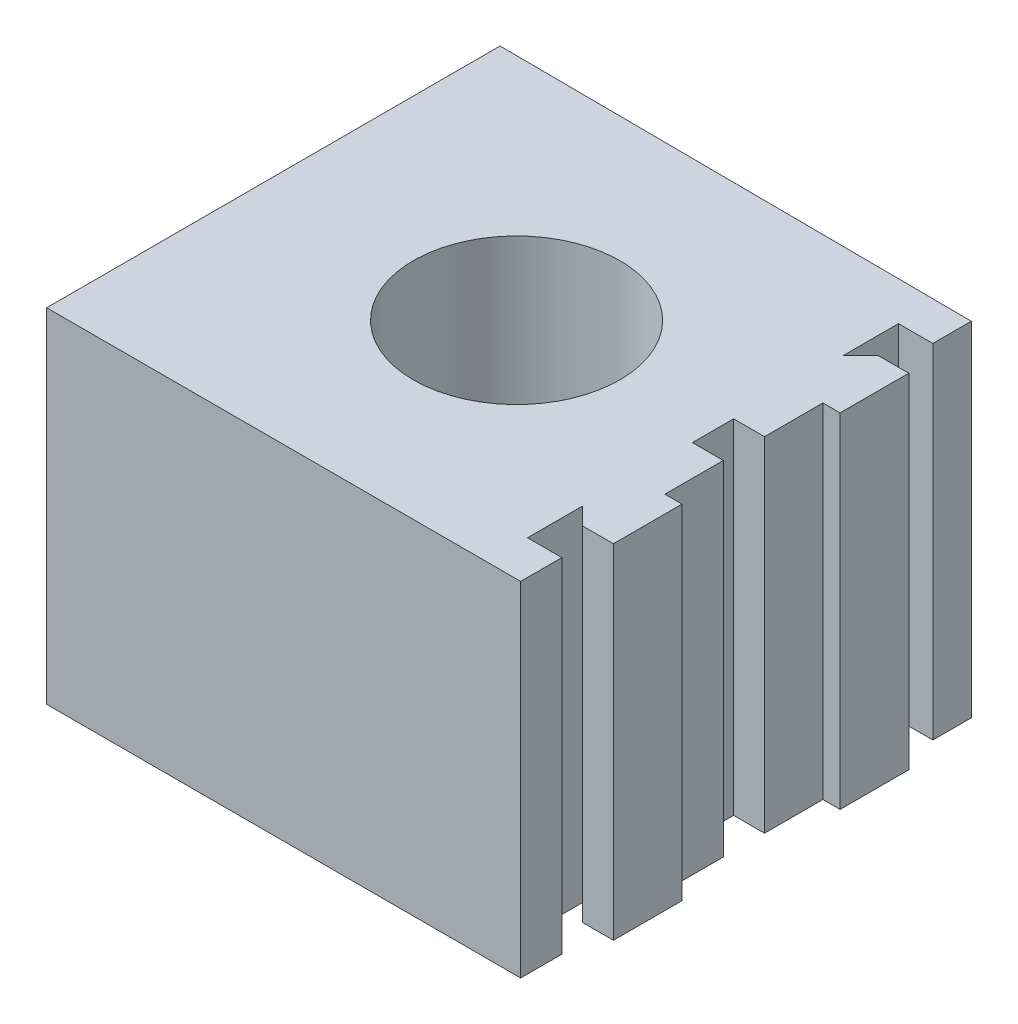
ISO-10303-21;
HEADER;
FILE_DESCRIPTION(('STEP AP214'),'2;1');
FILE_NAME('part.step','',(''),(''),'','','');
FILE_SCHEMA(('AUTOMOTIVE_DESIGN { 1 0 10303 214 1 1 1 1 }'));
ENDSEC;
DATA;
#1=APPLICATION_CONTEXT('core data for automotive mechanical design processes');
#2=APPLICATION_PROTOCOL_DEFINITION('international standard','automotive_design',2000,#1);
#3=PRODUCT_CONTEXT('',#1,'mechanical');
#4=PRODUCT('Part','Part','',(#3));
#5=PRODUCT_RELATED_PRODUCT_CATEGORY('part','',(#4));
#6=PRODUCT_DEFINITION_FORMATION('','',#4);
#7=PRODUCT_DEFINITION_CONTEXT('part definition',#1,'design');
#8=PRODUCT_DEFINITION('design','',#6,#7);
#9=PRODUCT_DEFINITION_SHAPE('','',#8);
#10=(LENGTH_UNIT() NAMED_UNIT(*) SI_UNIT(.MILLI.,.METRE.));
#11=(NAMED_UNIT(*) PLANE_ANGLE_UNIT() SI_UNIT($,.RADIAN.));
#12=(NAMED_UNIT(*) SI_UNIT($,.STERADIAN.) SOLID_ANGLE_UNIT());
#13=UNCERTAINTY_MEASURE_WITH_UNIT(LENGTH_MEASURE(1.E-05),#10,'distance_accuracy_value','');
#14=(GEOMETRIC_REPRESENTATION_CONTEXT(3) GLOBAL_UNCERTAINTY_ASSIGNED_CONTEXT((#13)) GLOBAL_UNIT_ASSIGNED_CONTEXT((#10,
#11,#12)) REPRESENTATION_CONTEXT('',''));
#15=CARTESIAN_POINT('',(0.,0.,0.));
#16=DIRECTION('',(0.,0.,1.));
#17=DIRECTION('',(1.,0.,0.));
#18=AXIS2_PLACEMENT_3D('',#15,#16,#17);
#19=CARTESIAN_POINT('',(3.32393026854168,-5.,-2.73562148246162));
#20=DIRECTION('',(1.,0.,0.));
#21=DIRECTION('',(0.,0.,-1.));
#22=AXIS2_PLACEMENT_3D('',#19,#20,#21);
#23=PLANE('',#22);
#24=DIRECTION('',(0.,0.,-1.));
#25=VECTOR('',#24,1.);
#26=CARTESIAN_POINT('',(3.32393026854168,0.,-2.73562148246162));
#27=LINE('',#26,#25);
#28=CARTESIAN_POINT('',(3.32393026854168,0.,-2.73562148246162));
#29=VERTEX_POINT('',#28);
#30=CARTESIAN_POINT('',(3.32393026854168,0.,-3.29583466670289));
#31=VERTEX_POINT('',#30);
#32=EDGE_CURVE('E213',#29,#31,#27,.T.);
#33=ORIENTED_EDGE('',*,*,#32,.F.);
#34=DIRECTION('',(0.,1.,0.));
#35=VECTOR('',#34,1.);
#36=CARTESIAN_POINT('',(3.32393026854168,-5.,-2.73562148246162));
#37=LINE('',#36,#35);
#38=CARTESIAN_POINT('',(3.32393026854168,-5.,-2.73562148246162));
#39=VERTEX_POINT('',#38);
#40=EDGE_CURVE('E11',#39,#29,#37,.T.);
#41=ORIENTED_EDGE('',*,*,#40,.F.);
#42=DIRECTION('',(0.,0.,-1.));
#43=VECTOR('',#42,1.);
#44=CARTESIAN_POINT('',(3.32393026854168,-5.,-2.73562148246162));
#45=LINE('',#44,#43);
#46=CARTESIAN_POINT('',(3.32393026854168,-5.,-3.29583466670289));
#47=VERTEX_POINT('',#46);
#48=EDGE_CURVE('E276',#39,#47,#45,.T.);
#49=ORIENTED_EDGE('',*,*,#48,.T.);
#50=DIRECTION('',(0.,1.,0.));
#51=VECTOR('',#50,1.);
#52=CARTESIAN_POINT('',(3.32393026854168,-5.,-3.29583466670289));
#53=LINE('',#52,#51);
#54=EDGE_CURVE('E35',#47,#31,#53,.T.);
#55=ORIENTED_EDGE('',*,*,#54,.T.);
#56=EDGE_LOOP('',(#33,#41,#49,#55));
#57=FACE_BOUND('',#56,.T.);
#58=ADVANCED_FACE('F32',(#57),#23,.T.);
#59=CARTESIAN_POINT('',(2.82393026854168,-5.,-2.73562148246162));
#60=DIRECTION('',(0.,0.,1.));
#61=DIRECTION('',(1.,0.,0.));
#62=AXIS2_PLACEMENT_3D('',#59,#60,#61);
#63=PLANE('',#62);
#64=DIRECTION('',(1.,0.,0.));
#65=VECTOR('',#64,1.);
#66=CARTESIAN_POINT('',(2.82393026854168,0.,-2.73562148246162));
#67=LINE('',#66,#65);
#68=CARTESIAN_POINT('',(2.82393026854168,0.,-2.73562148246162));
#69=VERTEX_POINT('',#68);
#70=EDGE_CURVE('E274',#69,#29,#67,.T.);
#71=ORIENTED_EDGE('',*,*,#70,.F.);
#72=DIRECTION('',(0.,1.,0.));
#73=VECTOR('',#72,1.);
#74=CARTESIAN_POINT('',(2.82393026854168,-5.,-2.73562148246162));
#75=LINE('',#74,#73);
#76=CARTESIAN_POINT('',(2.82393026854168,-5.,-2.73562148246162));
#77=VERTEX_POINT('',#76);
#78=EDGE_CURVE('E41',#77,#69,#75,.T.);
#79=ORIENTED_EDGE('',*,*,#78,.F.);
#80=DIRECTION('',(1.,0.,0.));
#81=VECTOR('',#80,1.);
#82=CARTESIAN_POINT('',(2.82393026854168,-5.,-2.73562148246162));
#83=LINE('',#82,#81);
#84=EDGE_CURVE('E203',#77,#39,#83,.T.);
#85=ORIENTED_EDGE('',*,*,#84,.T.);
#86=ORIENTED_EDGE('',*,*,#40,.T.);
#87=EDGE_LOOP('',(#71,#79,#85,#86));
#88=FACE_BOUND('',#87,.T.);
#89=ADVANCED_FACE('F316',(#88),#63,.T.);
#90=CARTESIAN_POINT('',(2.82393026854168,-5.,-1.93562148246162));
#91=DIRECTION('',(1.,0.,0.));
#92=DIRECTION('',(0.,0.,-1.));
#93=AXIS2_PLACEMENT_3D('',#90,#91,#92);
#94=PLANE('',#93);
#95=DIRECTION('',(0.,0.,-1.));
#96=VECTOR('',#95,1.);
#97=CARTESIAN_POINT('',(2.82393026854168,0.,-1.93562148246162));
#98=LINE('',#97,#96);
#99=CARTESIAN_POINT('',(2.82393026854168,0.,-1.93562148246162));
#100=VERTEX_POINT('',#99);
#101=EDGE_CURVE('E190',#100,#69,#98,.T.);
#102=ORIENTED_EDGE('',*,*,#101,.F.);
#103=DIRECTION('',(0.,1.,0.));
#104=VECTOR('',#103,1.);
#105=CARTESIAN_POINT('',(2.82393026854168,-5.,-1.93562148246162));
#106=LINE('',#105,#104);
#107=CARTESIAN_POINT('',(2.82393026854168,-5.,-1.93562148246162));
#108=VERTEX_POINT('',#107);
#109=EDGE_CURVE('E185',#108,#100,#106,.T.);
#110=ORIENTED_EDGE('',*,*,#109,.F.);
#111=DIRECTION('',(0.,0.,-1.));
#112=VECTOR('',#111,1.);
#113=CARTESIAN_POINT('',(2.82393026854168,-5.,-1.93562148246162));
#114=LINE('',#113,#112);
#115=EDGE_CURVE('E188',#108,#77,#114,.T.);
#116=ORIENTED_EDGE('',*,*,#115,.T.);
#117=ORIENTED_EDGE('',*,*,#78,.T.);
#118=EDGE_LOOP('',(#102,#110,#116,#117));
#119=FACE_BOUND('',#118,.T.);
#120=ADVANCED_FACE('F187',(#119),#94,.T.);
#121=CARTESIAN_POINT('',(3.07393026854168,-5.,-2.18562148246162));
#122=DIRECTION('',(-0.707106781186548,0.,-0.707106781186548));
#123=DIRECTION('',(-0.707106781186548,0.,0.707106781186548));
#124=AXIS2_PLACEMENT_3D('',#121,#122,#123);
#125=PLANE('',#124);
#126=DIRECTION('',(-0.707106781186547,0.,0.707106781186547));
#127=VECTOR('',#126,1.);
#128=CARTESIAN_POINT('',(3.07393026854168,0.,-2.18562148246162));
#129=LINE('',#128,#127);
#130=CARTESIAN_POINT('',(3.07393026854168,0.,-2.18562148246162));
#131=VERTEX_POINT('',#130);
#132=EDGE_CURVE('E271',#131,#100,#129,.T.);
#133=ORIENTED_EDGE('',*,*,#132,.F.);
#134=DIRECTION('',(0.,1.,0.));
#135=VECTOR('',#134,1.);
#136=CARTESIAN_POINT('',(3.07393026854168,-5.,-2.18562148246162));
#137=LINE('',#136,#135);
#138=CARTESIAN_POINT('',(3.07393026854168,-5.,-2.18562148246162));
#139=VERTEX_POINT('',#138);
#140=EDGE_CURVE('E195',#139,#131,#137,.T.);
#141=ORIENTED_EDGE('',*,*,#140,.F.);
#142=DIRECTION('',(-0.707106781186547,0.,0.707106781186547));
#143=VECTOR('',#142,1.);
#144=CARTESIAN_POINT('',(3.07393026854168,-5.,-2.18562148246162));
#145=LINE('',#144,#143);
#146=EDGE_CURVE('E201',#139,#108,#145,.T.);
#147=ORIENTED_EDGE('',*,*,#146,.T.);
#148=ORIENTED_EDGE('',*,*,#109,.T.);
#149=EDGE_LOOP('',(#133,#141,#147,#148));
#150=FACE_BOUND('',#149,.T.);
#151=ADVANCED_FACE('F205',(#150),#125,.T.);
#152=CARTESIAN_POINT('',(3.52393026854168,-5.,-2.18562148246162));
#153=DIRECTION('',(0.,0.,-1.));
#154=DIRECTION('',(-1.,0.,0.));
#155=AXIS2_PLACEMENT_3D('',#152,#153,#154);
#156=PLANE('',#155);
#157=DIRECTION('',(-1.,0.,0.));
#158=VECTOR('',#157,1.);
#159=CARTESIAN_POINT('',(3.52393026854168,0.,-2.18562148246162));
#160=LINE('',#159,#158);
#161=CARTESIAN_POINT('',(3.52393026854168,0.,-2.18562148246162));
#162=VERTEX_POINT('',#161);
#163=EDGE_CURVE('E268',#162,#131,#160,.T.);
#164=ORIENTED_EDGE('',*,*,#163,.F.);
#165=DIRECTION('',(0.,1.,0.));
#166=VECTOR('',#165,1.);
#167=CARTESIAN_POINT('',(3.52393026854168,-5.,-2.18562148246162));
#168=LINE('',#167,#166);
#169=CARTESIAN_POINT('',(3.52393026854168,-5.,-2.18562148246162));
#170=VERTEX_POINT('',#169);
#171=EDGE_CURVE('E280',#170,#162,#168,.T.);
#172=ORIENTED_EDGE('',*,*,#171,.F.);
#173=DIRECTION('',(-1.,0.,0.));
#174=VECTOR('',#173,1.);
#175=CARTESIAN_POINT('',(3.52393026854168,-5.,-2.18562148246162));
#176=LINE('',#175,#174);
#177=EDGE_CURVE('E206',#170,#139,#176,.T.);
#178=ORIENTED_EDGE('',*,*,#177,.T.);
#179=ORIENTED_EDGE('',*,*,#140,.T.);
#180=EDGE_LOOP('',(#164,#172,#178,#179));
#181=FACE_BOUND('',#180,.T.);
#182=ADVANCED_FACE('F329',(#181),#156,.T.);
#183=CARTESIAN_POINT('',(3.52393026854168,-5.,-1.18562148246162));
#184=DIRECTION('',(1.,0.,0.));
#185=DIRECTION('',(0.,0.,-1.));
#186=AXIS2_PLACEMENT_3D('',#183,#184,#185);
#187=PLANE('',#186);
#188=DIRECTION('',(0.,0.,-1.));
#189=VECTOR('',#188,1.);
#190=CARTESIAN_POINT('',(3.52393026854168,0.,-1.18562148246162));
#191=LINE('',#190,#189);
#192=CARTESIAN_POINT('',(3.52393026854168,0.,-1.18562148246162));
#193=VERTEX_POINT('',#192);
#194=EDGE_CURVE('E265',#193,#162,#191,.T.);
#195=ORIENTED_EDGE('',*,*,#194,.F.);
#196=DIRECTION('',(0.,1.,0.));
#197=VECTOR('',#196,1.);
#198=CARTESIAN_POINT('',(3.52393026854168,-5.,-1.18562148246162));
#199=LINE('',#198,#197);
#200=CARTESIAN_POINT('',(3.52393026854168,-5.,-1.18562148246162));
#201=VERTEX_POINT('',#200);
#202=EDGE_CURVE('E282',#201,#193,#199,.T.);
#203=ORIENTED_EDGE('',*,*,#202,.F.);
#204=DIRECTION('',(0.,0.,-1.));
#205=VECTOR('',#204,1.);
#206=CARTESIAN_POINT('',(3.52393026854168,-5.,-1.18562148246162));
#207=LINE('',#206,#205);
#208=EDGE_CURVE('E208',#201,#170,#207,.T.);
#209=ORIENTED_EDGE('',*,*,#208,.T.);
#210=ORIENTED_EDGE('',*,*,#171,.T.);
#211=EDGE_LOOP('',(#195,#203,#209,#210));
#212=FACE_BOUND('',#211,.T.);
#213=ADVANCED_FACE('F332',(#212),#187,.T.);
#214=CARTESIAN_POINT('',(3.27393026854168,-5.,-1.18562148246162));
#215=DIRECTION('',(0.,0.,1.));
#216=DIRECTION('',(1.,0.,0.));
#217=AXIS2_PLACEMENT_3D('',#214,#215,#216);
#218=PLANE('',#217);
#219=DIRECTION('',(1.,0.,0.));
#220=VECTOR('',#219,1.);
#221=CARTESIAN_POINT('',(3.27393026854168,0.,-1.18562148246162));
#222=LINE('',#221,#220);
#223=CARTESIAN_POINT('',(3.27393026854168,0.,-1.18562148246162));
#224=VERTEX_POINT('',#223);
#225=EDGE_CURVE('E262',#224,#193,#222,.T.);
#226=ORIENTED_EDGE('',*,*,#225,.F.);
#227=DIRECTION('',(0.,1.,0.));
#228=VECTOR('',#227,1.);
#229=CARTESIAN_POINT('',(3.27393026854168,-5.,-1.18562148246162));
#230=LINE('',#229,#228);
#231=CARTESIAN_POINT('',(3.27393026854168,-5.,-1.18562148246162));
#232=VERTEX_POINT('',#231);
#233=EDGE_CURVE('E284',#232,#224,#230,.T.);
#234=ORIENTED_EDGE('',*,*,#233,.F.);
#235=DIRECTION('',(1.,0.,0.));
#236=VECTOR('',#235,1.);
#237=CARTESIAN_POINT('',(3.27393026854168,-5.,-1.18562148246162));
#238=LINE('',#237,#236);
#239=EDGE_CURVE('E465',#232,#201,#238,.T.);
#240=ORIENTED_EDGE('',*,*,#239,.T.);
#241=ORIENTED_EDGE('',*,*,#202,.T.);
#242=EDGE_LOOP('',(#226,#234,#240,#241));
#243=FACE_BOUND('',#242,.T.);
#244=ADVANCED_FACE('F336',(#243),#218,.T.);
#245=CARTESIAN_POINT('',(3.27393026854168,-5.,-0.335621482461617));
#246=DIRECTION('',(1.,0.,0.));
#247=DIRECTION('',(0.,0.,-1.));
#248=AXIS2_PLACEMENT_3D('',#245,#246,#247);
#249=PLANE('',#248);
#250=DIRECTION('',(0.,0.,-1.));
#251=VECTOR('',#250,1.);
#252=CARTESIAN_POINT('',(3.27393026854168,0.,-0.335621482461617));
#253=LINE('',#252,#251);
#254=CARTESIAN_POINT('',(3.27393026854168,0.,-0.335621482461617));
#255=VERTEX_POINT('',#254);
#256=EDGE_CURVE('E259',#255,#224,#253,.T.);
#257=ORIENTED_EDGE('',*,*,#256,.F.);
#258=DIRECTION('',(0.,1.,0.));
#259=VECTOR('',#258,1.);
#260=CARTESIAN_POINT('',(3.27393026854168,-5.,-0.335621482461617));
#261=LINE('',#260,#259);
#262=CARTESIAN_POINT('',(3.27393026854168,-5.,-0.335621482461617));
#263=VERTEX_POINT('',#262);
#264=EDGE_CURVE('E286',#263,#255,#261,.T.);
#265=ORIENTED_EDGE('',*,*,#264,.F.);
#266=DIRECTION('',(0.,0.,-1.));
#267=VECTOR('',#266,1.);
#268=CARTESIAN_POINT('',(3.27393026854168,-5.,-0.335621482461617));
#269=LINE('',#268,#267);
#270=EDGE_CURVE('E462',#263,#232,#269,.T.);
#271=ORIENTED_EDGE('',*,*,#270,.T.);
#272=ORIENTED_EDGE('',*,*,#233,.T.);
#273=EDGE_LOOP('',(#257,#265,#271,#272));
#274=FACE_BOUND('',#273,.T.);
#275=ADVANCED_FACE('F340',(#274),#249,.T.);
#276=CARTESIAN_POINT('',(2.82393026854168,-5.,-0.335621482461617));
#277=DIRECTION('',(0.,0.,1.));
#278=DIRECTION('',(1.,0.,0.));
#279=AXIS2_PLACEMENT_3D('',#276,#277,#278);
#280=PLANE('',#279);
#281=DIRECTION('',(1.,0.,0.));
#282=VECTOR('',#281,1.);
#283=CARTESIAN_POINT('',(2.82393026854168,0.,-0.335621482461617));
#284=LINE('',#283,#282);
#285=CARTESIAN_POINT('',(2.82393026854168,0.,-0.335621482461617));
#286=VERTEX_POINT('',#285);
#287=EDGE_CURVE('E256',#286,#255,#284,.T.);
#288=ORIENTED_EDGE('',*,*,#287,.F.);
#289=DIRECTION('',(0.,1.,0.));
#290=VECTOR('',#289,1.);
#291=CARTESIAN_POINT('',(2.82393026854168,-5.,-0.335621482461617));
#292=LINE('',#291,#290);
#293=CARTESIAN_POINT('',(2.82393026854168,-5.,-0.335621482461617));
#294=VERTEX_POINT('',#293);
#295=EDGE_CURVE('E288',#294,#286,#292,.T.);
#296=ORIENTED_EDGE('',*,*,#295,.F.);
#297=DIRECTION('',(1.,0.,0.));
#298=VECTOR('',#297,1.);
#299=CARTESIAN_POINT('',(2.82393026854168,-5.,-0.335621482461617));
#300=LINE('',#299,#298);
#301=EDGE_CURVE('E459',#294,#263,#300,.T.);
#302=ORIENTED_EDGE('',*,*,#301,.T.);
#303=ORIENTED_EDGE('',*,*,#264,.T.);
#304=EDGE_LOOP('',(#288,#296,#302,#303));
#305=FACE_BOUND('',#304,.T.);
#306=ADVANCED_FACE('F344',(#305),#280,.T.);
#307=CARTESIAN_POINT('',(2.82393026854168,-5.,0.264378517538383));
#308=DIRECTION('',(1.,0.,0.));
#309=DIRECTION('',(0.,0.,-1.));
#310=AXIS2_PLACEMENT_3D('',#307,#308,#309);
#311=PLANE('',#310);
#312=DIRECTION('',(0.,0.,-1.));
#313=VECTOR('',#312,1.);
#314=CARTESIAN_POINT('',(2.82393026854168,0.,0.264378517538383));
#315=LINE('',#314,#313);
#316=CARTESIAN_POINT('',(2.82393026854168,0.,0.264378517538383));
#317=VERTEX_POINT('',#316);
#318=EDGE_CURVE('E253',#317,#286,#315,.T.);
#319=ORIENTED_EDGE('',*,*,#318,.F.);
#320=DIRECTION('',(0.,1.,0.));
#321=VECTOR('',#320,1.);
#322=CARTESIAN_POINT('',(2.82393026854168,-5.,0.264378517538383));
#323=LINE('',#322,#321);
#324=CARTESIAN_POINT('',(2.82393026854168,-5.,0.264378517538383));
#325=VERTEX_POINT('',#324);
#326=EDGE_CURVE('E290',#325,#317,#323,.T.);
#327=ORIENTED_EDGE('',*,*,#326,.F.);
#328=DIRECTION('',(0.,0.,-1.));
#329=VECTOR('',#328,1.);
#330=CARTESIAN_POINT('',(2.82393026854168,-5.,0.264378517538383));
#331=LINE('',#330,#329);
#332=EDGE_CURVE('E456',#325,#294,#331,.T.);
#333=ORIENTED_EDGE('',*,*,#332,.T.);
#334=ORIENTED_EDGE('',*,*,#295,.T.);
#335=EDGE_LOOP('',(#319,#327,#333,#334));
#336=FACE_BOUND('',#335,.T.);
#337=ADVANCED_FACE('F348',(#336),#311,.T.);
#338=CARTESIAN_POINT('',(3.27393026854168,-5.,0.264378517538383));
#339=DIRECTION('',(0.,0.,-1.));
#340=DIRECTION('',(-1.,0.,0.));
#341=AXIS2_PLACEMENT_3D('',#338,#339,#340);
#342=PLANE('',#341);
#343=DIRECTION('',(-1.,0.,0.));
#344=VECTOR('',#343,1.);
#345=CARTESIAN_POINT('',(3.27393026854168,0.,0.264378517538383));
#346=LINE('',#345,#344);
#347=CARTESIAN_POINT('',(3.27393026854168,0.,0.264378517538383));
#348=VERTEX_POINT('',#347);
#349=EDGE_CURVE('E250',#348,#317,#346,.T.);
#350=ORIENTED_EDGE('',*,*,#349,.F.);
#351=DIRECTION('',(0.,1.,0.));
#352=VECTOR('',#351,1.);
#353=CARTESIAN_POINT('',(3.27393026854168,-5.,0.264378517538383));
#354=LINE('',#353,#352);
#355=CARTESIAN_POINT('',(3.27393026854168,-5.,0.264378517538383));
#356=VERTEX_POINT('',#355);
#357=EDGE_CURVE('E292',#356,#348,#354,.T.);
#358=ORIENTED_EDGE('',*,*,#357,.F.);
#359=DIRECTION('',(-1.,0.,0.));
#360=VECTOR('',#359,1.);
#361=CARTESIAN_POINT('',(3.27393026854168,-5.,0.264378517538383));
#362=LINE('',#361,#360);
#363=EDGE_CURVE('E453',#356,#325,#362,.T.);
#364=ORIENTED_EDGE('',*,*,#363,.T.);
#365=ORIENTED_EDGE('',*,*,#326,.T.);
#366=EDGE_LOOP('',(#350,#358,#364,#365));
#367=FACE_BOUND('',#366,.T.);
#368=ADVANCED_FACE('F352',(#367),#342,.T.);
#369=CARTESIAN_POINT('',(3.27393026854168,-5.,1.11437851753838));
#370=DIRECTION('',(1.,0.,0.));
#371=DIRECTION('',(0.,0.,-1.));
#372=AXIS2_PLACEMENT_3D('',#369,#370,#371);
#373=PLANE('',#372);
#374=DIRECTION('',(0.,0.,-1.));
#375=VECTOR('',#374,1.);
#376=CARTESIAN_POINT('',(3.27393026854168,0.,1.11437851753838));
#377=LINE('',#376,#375);
#378=CARTESIAN_POINT('',(3.27393026854168,0.,1.11437851753838));
#379=VERTEX_POINT('',#378);
#380=EDGE_CURVE('E247',#379,#348,#377,.T.);
#381=ORIENTED_EDGE('',*,*,#380,.F.);
#382=DIRECTION('',(0.,1.,0.));
#383=VECTOR('',#382,1.);
#384=CARTESIAN_POINT('',(3.27393026854168,-5.,1.11437851753838));
#385=LINE('',#384,#383);
#386=CARTESIAN_POINT('',(3.27393026854168,-5.,1.11437851753838));
#387=VERTEX_POINT('',#386);
#388=EDGE_CURVE('E294',#387,#379,#385,.T.);
#389=ORIENTED_EDGE('',*,*,#388,.F.);
#390=DIRECTION('',(0.,0.,-1.));
#391=VECTOR('',#390,1.);
#392=CARTESIAN_POINT('',(3.27393026854168,-5.,1.11437851753838));
#393=LINE('',#392,#391);
#394=EDGE_CURVE('E450',#387,#356,#393,.T.);
#395=ORIENTED_EDGE('',*,*,#394,.T.);
#396=ORIENTED_EDGE('',*,*,#357,.T.);
#397=EDGE_LOOP('',(#381,#389,#395,#396));
#398=FACE_BOUND('',#397,.T.);
#399=ADVANCED_FACE('F356',(#398),#373,.T.);
#400=CARTESIAN_POINT('',(3.52393026854168,-5.,1.11437851753838));
#401=DIRECTION('',(0.,0.,-1.));
#402=DIRECTION('',(-1.,0.,0.));
#403=AXIS2_PLACEMENT_3D('',#400,#401,#402);
#404=PLANE('',#403);
#405=DIRECTION('',(-1.,0.,0.));
#406=VECTOR('',#405,1.);
#407=CARTESIAN_POINT('',(3.52393026854168,0.,1.11437851753838));
#408=LINE('',#407,#406);
#409=CARTESIAN_POINT('',(3.52393026854168,0.,1.11437851753838));
#410=VERTEX_POINT('',#409);
#411=EDGE_CURVE('E244',#410,#379,#408,.T.);
#412=ORIENTED_EDGE('',*,*,#411,.F.);
#413=DIRECTION('',(0.,1.,0.));
#414=VECTOR('',#413,1.);
#415=CARTESIAN_POINT('',(3.52393026854168,-5.,1.11437851753838));
#416=LINE('',#415,#414);
#417=CARTESIAN_POINT('',(3.52393026854168,-5.,1.11437851753838));
#418=VERTEX_POINT('',#417);
#419=EDGE_CURVE('E296',#418,#410,#416,.T.);
#420=ORIENTED_EDGE('',*,*,#419,.F.);
#421=DIRECTION('',(-1.,0.,0.));
#422=VECTOR('',#421,1.);
#423=CARTESIAN_POINT('',(3.52393026854168,-5.,1.11437851753838));
#424=LINE('',#423,#422);
#425=EDGE_CURVE('E447',#418,#387,#424,.T.);
#426=ORIENTED_EDGE('',*,*,#425,.T.);
#427=ORIENTED_EDGE('',*,*,#388,.T.);
#428=EDGE_LOOP('',(#412,#420,#426,#427));
#429=FACE_BOUND('',#428,.T.);
#430=ADVANCED_FACE('F360',(#429),#404,.T.);
#431=CARTESIAN_POINT('',(3.52393026854168,-5.,2.11437851753838));
#432=DIRECTION('',(1.,0.,0.));
#433=DIRECTION('',(0.,0.,-1.));
#434=AXIS2_PLACEMENT_3D('',#431,#432,#433);
#435=PLANE('',#434);
#436=DIRECTION('',(0.,0.,-1.));
#437=VECTOR('',#436,1.);
#438=CARTESIAN_POINT('',(3.52393026854168,0.,2.11437851753838));
#439=LINE('',#438,#437);
#440=CARTESIAN_POINT('',(3.52393026854168,0.,2.11437851753838));
#441=VERTEX_POINT('',#440);
#442=EDGE_CURVE('E241',#441,#410,#439,.T.);
#443=ORIENTED_EDGE('',*,*,#442,.F.);
#444=DIRECTION('',(0.,1.,0.));
#445=VECTOR('',#444,1.);
#446=CARTESIAN_POINT('',(3.52393026854168,-5.,2.11437851753838));
#447=LINE('',#446,#445);
#448=CARTESIAN_POINT('',(3.52393026854168,-5.,2.11437851753838));
#449=VERTEX_POINT('',#448);
#450=EDGE_CURVE('E298',#449,#441,#447,.T.);
#451=ORIENTED_EDGE('',*,*,#450,.F.);
#452=DIRECTION('',(0.,0.,-1.));
#453=VECTOR('',#452,1.);
#454=CARTESIAN_POINT('',(3.52393026854168,-5.,2.11437851753838));
#455=LINE('',#454,#453);
#456=EDGE_CURVE('E444',#449,#418,#455,.T.);
#457=ORIENTED_EDGE('',*,*,#456,.T.);
#458=ORIENTED_EDGE('',*,*,#419,.T.);
#459=EDGE_LOOP('',(#443,#451,#457,#458));
#460=FACE_BOUND('',#459,.T.);
#461=ADVANCED_FACE('F364',(#460),#435,.T.);
#462=CARTESIAN_POINT('',(3.07393026854168,-5.,2.11437851753838));
#463=DIRECTION('',(0.,0.,1.));
#464=DIRECTION('',(1.,0.,0.));
#465=AXIS2_PLACEMENT_3D('',#462,#463,#464);
#466=PLANE('',#465);
#467=DIRECTION('',(1.,0.,0.));
#468=VECTOR('',#467,1.);
#469=CARTESIAN_POINT('',(3.07393026854168,0.,2.11437851753838));
#470=LINE('',#469,#468);
#471=CARTESIAN_POINT('',(3.07393026854168,0.,2.11437851753838));
#472=VERTEX_POINT('',#471);
#473=EDGE_CURVE('E238',#472,#441,#470,.T.);
#474=ORIENTED_EDGE('',*,*,#473,.F.);
#475=DIRECTION('',(0.,1.,0.));
#476=VECTOR('',#475,1.);
#477=CARTESIAN_POINT('',(3.07393026854168,-5.,2.11437851753838));
#478=LINE('',#477,#476);
#479=CARTESIAN_POINT('',(3.07393026854168,-5.,2.11437851753838));
#480=VERTEX_POINT('',#479);
#481=EDGE_CURVE('E300',#480,#472,#478,.T.);
#482=ORIENTED_EDGE('',*,*,#481,.F.);
#483=DIRECTION('',(1.,0.,0.));
#484=VECTOR('',#483,1.);
#485=CARTESIAN_POINT('',(3.07393026854168,-5.,2.11437851753838));
#486=LINE('',#485,#484);
#487=EDGE_CURVE('E441',#480,#449,#486,.T.);
#488=ORIENTED_EDGE('',*,*,#487,.T.);
#489=ORIENTED_EDGE('',*,*,#450,.T.);
#490=EDGE_LOOP('',(#474,#482,#488,#489));
#491=FACE_BOUND('',#490,.T.);
#492=ADVANCED_FACE('F368',(#491),#466,.T.);
#493=CARTESIAN_POINT('',(2.82393026854168,-5.,1.86437851753838));
#494=DIRECTION('',(-0.707106781186547,0.,0.707106781186548));
#495=DIRECTION('',(0.707106781186548,0.,0.707106781186547));
#496=AXIS2_PLACEMENT_3D('',#493,#494,#495);
#497=PLANE('',#496);
#498=DIRECTION('',(0.707106781186548,0.,0.707106781186547));
#499=VECTOR('',#498,1.);
#500=CARTESIAN_POINT('',(2.82393026854168,0.,1.86437851753838));
#501=LINE('',#500,#499);
#502=CARTESIAN_POINT('',(2.82393026854168,0.,1.86437851753838));
#503=VERTEX_POINT('',#502);
#504=EDGE_CURVE('E235',#503,#472,#501,.T.);
#505=ORIENTED_EDGE('',*,*,#504,.F.);
#506=DIRECTION('',(0.,1.,0.));
#507=VECTOR('',#506,1.);
#508=CARTESIAN_POINT('',(2.82393026854168,-5.,1.86437851753838));
#509=LINE('',#508,#507);
#510=CARTESIAN_POINT('',(2.82393026854168,-5.,1.86437851753838));
#511=VERTEX_POINT('',#510);
#512=EDGE_CURVE('E302',#511,#503,#509,.T.);
#513=ORIENTED_EDGE('',*,*,#512,.F.);
#514=DIRECTION('',(0.707106781186548,0.,0.707106781186547));
#515=VECTOR('',#514,1.);
#516=CARTESIAN_POINT('',(2.82393026854168,-5.,1.86437851753838));
#517=LINE('',#516,#515);
#518=EDGE_CURVE('E438',#511,#480,#517,.T.);
#519=ORIENTED_EDGE('',*,*,#518,.T.);
#520=ORIENTED_EDGE('',*,*,#481,.T.);
#521=EDGE_LOOP('',(#505,#513,#519,#520));
#522=FACE_BOUND('',#521,.T.);
#523=ADVANCED_FACE('F372',(#522),#497,.T.);
#524=CARTESIAN_POINT('',(2.82393026854168,-5.,2.66437851753838));
#525=DIRECTION('',(1.,0.,0.));
#526=DIRECTION('',(0.,0.,-1.));
#527=AXIS2_PLACEMENT_3D('',#524,#525,#526);
#528=PLANE('',#527);
#529=DIRECTION('',(0.,0.,-1.));
#530=VECTOR('',#529,1.);
#531=CARTESIAN_POINT('',(2.82393026854168,0.,2.66437851753838));
#532=LINE('',#531,#530);
#533=CARTESIAN_POINT('',(2.82393026854168,0.,2.66437851753838));
#534=VERTEX_POINT('',#533);
#535=EDGE_CURVE('E232',#534,#503,#532,.T.);
#536=ORIENTED_EDGE('',*,*,#535,.F.);
#537=DIRECTION('',(0.,1.,0.));
#538=VECTOR('',#537,1.);
#539=CARTESIAN_POINT('',(2.82393026854168,-5.,2.66437851753838));
#540=LINE('',#539,#538);
#541=CARTESIAN_POINT('',(2.82393026854168,-5.,2.66437851753838));
#542=VERTEX_POINT('',#541);
#543=EDGE_CURVE('E304',#542,#534,#540,.T.);
#544=ORIENTED_EDGE('',*,*,#543,.F.);
#545=DIRECTION('',(0.,0.,-1.));
#546=VECTOR('',#545,1.);
#547=CARTESIAN_POINT('',(2.82393026854168,-5.,2.66437851753838));
#548=LINE('',#547,#546);
#549=EDGE_CURVE('E435',#542,#511,#548,.T.);
#550=ORIENTED_EDGE('',*,*,#549,.T.);
#551=ORIENTED_EDGE('',*,*,#512,.T.);
#552=EDGE_LOOP('',(#536,#544,#550,#551));
#553=FACE_BOUND('',#552,.T.);
#554=ADVANCED_FACE('F376',(#553),#528,.T.);
#555=CARTESIAN_POINT('',(3.32393026854168,-5.,2.66437851753838));
#556=DIRECTION('',(0.,0.,-1.));
#557=DIRECTION('',(-1.,0.,0.));
#558=AXIS2_PLACEMENT_3D('',#555,#556,#557);
#559=PLANE('',#558);
#560=DIRECTION('',(-1.,0.,0.));
#561=VECTOR('',#560,1.);
#562=CARTESIAN_POINT('',(3.32393026854168,0.,2.66437851753838));
#563=LINE('',#562,#561);
#564=CARTESIAN_POINT('',(3.32393026854168,0.,2.66437851753838));
#565=VERTEX_POINT('',#564);
#566=EDGE_CURVE('E229',#565,#534,#563,.T.);
#567=ORIENTED_EDGE('',*,*,#566,.F.);
#568=DIRECTION('',(0.,1.,0.));
#569=VECTOR('',#568,1.);
#570=CARTESIAN_POINT('',(3.32393026854168,-5.,2.66437851753838));
#571=LINE('',#570,#569);
#572=CARTESIAN_POINT('',(3.32393026854168,-5.,2.66437851753838));
#573=VERTEX_POINT('',#572);
#574=EDGE_CURVE('E306',#573,#565,#571,.T.);
#575=ORIENTED_EDGE('',*,*,#574,.F.);
#576=DIRECTION('',(-1.,0.,0.));
#577=VECTOR('',#576,1.);
#578=CARTESIAN_POINT('',(3.32393026854168,-5.,2.66437851753838));
#579=LINE('',#578,#577);
#580=EDGE_CURVE('E432',#573,#542,#579,.T.);
#581=ORIENTED_EDGE('',*,*,#580,.T.);
#582=ORIENTED_EDGE('',*,*,#543,.T.);
#583=EDGE_LOOP('',(#567,#575,#581,#582));
#584=FACE_BOUND('',#583,.T.);
#585=ADVANCED_FACE('F380',(#584),#559,.T.);
#586=CARTESIAN_POINT('',(3.32393026854168,-5.,3.26437851753838));
#587=DIRECTION('',(1.,0.,0.));
#588=DIRECTION('',(0.,0.,-1.));
#589=AXIS2_PLACEMENT_3D('',#586,#587,#588);
#590=PLANE('',#589);
#591=DIRECTION('',(0.,0.,-1.));
#592=VECTOR('',#591,1.);
#593=CARTESIAN_POINT('',(3.32393026854168,0.,3.26437851753838));
#594=LINE('',#593,#592);
#595=CARTESIAN_POINT('',(3.32393026854168,0.,3.26437851753838));
#596=VERTEX_POINT('',#595);
#597=EDGE_CURVE('E226',#596,#565,#594,.T.);
#598=ORIENTED_EDGE('',*,*,#597,.F.);
#599=DIRECTION('',(0.,1.,0.));
#600=VECTOR('',#599,1.);
#601=CARTESIAN_POINT('',(3.32393026854168,-5.,3.26437851753838));
#602=LINE('',#601,#600);
#603=CARTESIAN_POINT('',(3.32393026854168,-5.,3.26437851753838));
#604=VERTEX_POINT('',#603);
#605=EDGE_CURVE('E308',#604,#596,#602,.T.);
#606=ORIENTED_EDGE('',*,*,#605,.F.);
#607=DIRECTION('',(0.,0.,-1.));
#608=VECTOR('',#607,1.);
#609=CARTESIAN_POINT('',(3.32393026854168,-5.,3.26437851753838));
#610=LINE('',#609,#608);
#611=EDGE_CURVE('E429',#604,#573,#610,.T.);
#612=ORIENTED_EDGE('',*,*,#611,.T.);
#613=ORIENTED_EDGE('',*,*,#574,.T.);
#614=EDGE_LOOP('',(#598,#606,#612,#613));
#615=FACE_BOUND('',#614,.T.);
#616=ADVANCED_FACE('F384',(#615),#590,.T.);
#617=CARTESIAN_POINT('',(-3.57606973145832,-5.,3.26437851753838));
#618=DIRECTION('',(0.,0.,1.));
#619=DIRECTION('',(1.,0.,0.));
#620=AXIS2_PLACEMENT_3D('',#617,#618,#619);
#621=PLANE('',#620);
#622=DIRECTION('',(1.,0.,0.));
#623=VECTOR('',#622,1.);
#624=CARTESIAN_POINT('',(-3.57606973145832,0.,3.26437851753838));
#625=LINE('',#624,#623);
#626=CARTESIAN_POINT('',(-3.57606973145832,0.,3.26437851753838));
#627=VERTEX_POINT('',#626);
#628=EDGE_CURVE('E223',#627,#596,#625,.T.);
#629=ORIENTED_EDGE('',*,*,#628,.F.);
#630=DIRECTION('',(0.,1.,0.));
#631=VECTOR('',#630,1.);
#632=CARTESIAN_POINT('',(-3.57606973145832,-5.,3.26437851753838));
#633=LINE('',#632,#631);
#634=CARTESIAN_POINT('',(-3.57606973145832,-5.,3.26437851753838));
#635=VERTEX_POINT('',#634);
#636=EDGE_CURVE('E310',#635,#627,#633,.T.);
#637=ORIENTED_EDGE('',*,*,#636,.F.);
#638=DIRECTION('',(1.,0.,0.));
#639=VECTOR('',#638,1.);
#640=CARTESIAN_POINT('',(-3.57606973145832,-5.,3.26437851753838));
#641=LINE('',#640,#639);
#642=EDGE_CURVE('E426',#635,#604,#641,.T.);
#643=ORIENTED_EDGE('',*,*,#642,.T.);
#644=ORIENTED_EDGE('',*,*,#605,.T.);
#645=EDGE_LOOP('',(#629,#637,#643,#644));
#646=FACE_BOUND('',#645,.T.);
#647=ADVANCED_FACE('F388',(#646),#621,.T.);
#648=CARTESIAN_POINT('',(-3.57606973145832,-5.,-3.33562148246162));
#649=DIRECTION('',(-1.,0.,0.));
#650=DIRECTION('',(0.,0.,1.));
#651=AXIS2_PLACEMENT_3D('',#648,#649,#650);
#652=PLANE('',#651);
#653=DIRECTION('',(0.,0.,1.));
#654=VECTOR('',#653,1.);
#655=CARTESIAN_POINT('',(-3.57606973145832,0.,-3.33562148246162));
#656=LINE('',#655,#654);
#657=CARTESIAN_POINT('',(-3.57606973145832,0.,-3.33562148246162));
#658=VERTEX_POINT('',#657);
#659=EDGE_CURVE('E220',#658,#627,#656,.T.);
#660=ORIENTED_EDGE('',*,*,#659,.F.);
#661=DIRECTION('',(0.,1.,0.));
#662=VECTOR('',#661,1.);
#663=CARTESIAN_POINT('',(-3.57606973145832,-5.,-3.33562148246162));
#664=LINE('',#663,#662);
#665=CARTESIAN_POINT('',(-3.57606973145832,-5.,-3.33562148246162));
#666=VERTEX_POINT('',#665);
#667=EDGE_CURVE('E311',#666,#658,#664,.T.);
#668=ORIENTED_EDGE('',*,*,#667,.F.);
#669=DIRECTION('',(0.,0.,1.));
#670=VECTOR('',#669,1.);
#671=CARTESIAN_POINT('',(-3.57606973145832,-5.,-3.33562148246162));
#672=LINE('',#671,#670);
#673=EDGE_CURVE('E423',#666,#635,#672,.T.);
#674=ORIENTED_EDGE('',*,*,#673,.T.);
#675=ORIENTED_EDGE('',*,*,#636,.T.);
#676=EDGE_LOOP('',(#660,#668,#674,#675));
#677=FACE_BOUND('',#676,.T.);
#678=ADVANCED_FACE('F392',(#677),#652,.T.);
#679=CARTESIAN_POINT('',(3.32393026854168,-5.,-3.29583466670289));
#680=DIRECTION('',(0.00576610932418409,0.,-0.99998337585345));
#681=DIRECTION('',(-0.99998337585345,0.,-0.00576610932418409));
#682=AXIS2_PLACEMENT_3D('',#679,#680,#681);
#683=PLANE('',#682);
#684=DIRECTION('',(-0.99998337585345,0.,-0.00576610932418409));
#685=VECTOR('',#684,1.);
#686=CARTESIAN_POINT('',(3.32393026854168,0.,-3.29583466670289));
#687=LINE('',#686,#685);
#688=EDGE_CURVE('E216',#31,#658,#687,.T.);
#689=ORIENTED_EDGE('',*,*,#688,.F.);
#690=ORIENTED_EDGE('',*,*,#54,.F.);
#691=DIRECTION('',(-0.99998337585345,0.,-0.00576610932418409));
#692=VECTOR('',#691,1.);
#693=CARTESIAN_POINT('',(3.32393026854168,-5.,-3.29583466670289));
#694=LINE('',#693,#692);
#695=EDGE_CURVE('E421',#47,#666,#694,.T.);
#696=ORIENTED_EDGE('',*,*,#695,.T.);
#697=ORIENTED_EDGE('',*,*,#667,.T.);
#698=EDGE_LOOP('',(#689,#690,#696,#697));
#699=FACE_BOUND('',#698,.T.);
#700=ADVANCED_FACE('F313',(#699),#683,.T.);
#701=CARTESIAN_POINT('',(0.,-5.,0.));
#702=DIRECTION('',(0.,-1.,0.));
#703=DIRECTION('',(0.,0.,-1.));
#704=AXIS2_PLACEMENT_3D('',#701,#702,#703);
#705=PLANE('',#704);
#706=CARTESIAN_POINT('',(0.00194885432695628,-5.,0.00175693218553829));
#707=DIRECTION('',(0.,1.,0.));
#708=DIRECTION('',(0.,0.,1.));
#709=AXIS2_PLACEMENT_3D('',#706,#707,#708);
#710=CIRCLE('',#709,1.50378018014304);
#711=CARTESIAN_POINT('',(0.00194885432695628,-5.,1.50553711232858));
#712=VERTEX_POINT('',#711);
#713=EDGE_CURVE('E217',#712,#712,#710,.T.);
#714=ORIENTED_EDGE('',*,*,#713,.T.);
#715=EDGE_LOOP('',(#714));
#716=FACE_BOUND('',#715,.T.);
#717=ORIENTED_EDGE('',*,*,#48,.F.);
#718=ORIENTED_EDGE('',*,*,#84,.F.);
#719=ORIENTED_EDGE('',*,*,#115,.F.);
#720=ORIENTED_EDGE('',*,*,#146,.F.);
#721=ORIENTED_EDGE('',*,*,#177,.F.);
#722=ORIENTED_EDGE('',*,*,#208,.F.);
#723=ORIENTED_EDGE('',*,*,#239,.F.);
#724=ORIENTED_EDGE('',*,*,#270,.F.);
#725=ORIENTED_EDGE('',*,*,#301,.F.);
#726=ORIENTED_EDGE('',*,*,#332,.F.);
#727=ORIENTED_EDGE('',*,*,#363,.F.);
#728=ORIENTED_EDGE('',*,*,#394,.F.);
#729=ORIENTED_EDGE('',*,*,#425,.F.);
#730=ORIENTED_EDGE('',*,*,#456,.F.);
#731=ORIENTED_EDGE('',*,*,#487,.F.);
#732=ORIENTED_EDGE('',*,*,#518,.F.);
#733=ORIENTED_EDGE('',*,*,#549,.F.);
#734=ORIENTED_EDGE('',*,*,#580,.F.);
#735=ORIENTED_EDGE('',*,*,#611,.F.);
#736=ORIENTED_EDGE('',*,*,#642,.F.);
#737=ORIENTED_EDGE('',*,*,#673,.F.);
#738=ORIENTED_EDGE('',*,*,#695,.F.);
#739=EDGE_LOOP('',(#717,#718,#719,#720,#721,#722,#723,#724,#725,#726,#727,#728,#729,#730,#731,
#732,#733,#734,#735,#736,#737,#738));
#740=FACE_BOUND('',#739,.T.);
#741=ADVANCED_FACE('F199',(#716,#740),#705,.T.);
#742=CARTESIAN_POINT('',(0.,0.,0.));
#743=DIRECTION('',(0.,-1.,0.));
#744=DIRECTION('',(0.,0.,-1.));
#745=AXIS2_PLACEMENT_3D('',#742,#743,#744);
#746=PLANE('',#745);
#747=CARTESIAN_POINT('',(0.00194885432695628,0.,0.00175693218553829));
#748=DIRECTION('',(0.,1.,0.));
#749=DIRECTION('',(0.,0.,1.));
#750=AXIS2_PLACEMENT_3D('',#747,#748,#749);
#751=CIRCLE('',#750,1.50378018014304);
#752=CARTESIAN_POINT('',(0.00194885432695628,0.,1.50553711232858));
#753=VERTEX_POINT('',#752);
#754=EDGE_CURVE('E415',#753,#753,#751,.T.);
#755=ORIENTED_EDGE('',*,*,#754,.F.);
#756=EDGE_LOOP('',(#755));
#757=FACE_BOUND('',#756,.T.);
#758=ORIENTED_EDGE('',*,*,#32,.T.);
#759=ORIENTED_EDGE('',*,*,#688,.T.);
#760=ORIENTED_EDGE('',*,*,#659,.T.);
#761=ORIENTED_EDGE('',*,*,#628,.T.);
#762=ORIENTED_EDGE('',*,*,#597,.T.);
#763=ORIENTED_EDGE('',*,*,#566,.T.);
#764=ORIENTED_EDGE('',*,*,#535,.T.);
#765=ORIENTED_EDGE('',*,*,#504,.T.);
#766=ORIENTED_EDGE('',*,*,#473,.T.);
#767=ORIENTED_EDGE('',*,*,#442,.T.);
#768=ORIENTED_EDGE('',*,*,#411,.T.);
#769=ORIENTED_EDGE('',*,*,#380,.T.);
#770=ORIENTED_EDGE('',*,*,#349,.T.);
#771=ORIENTED_EDGE('',*,*,#318,.T.);
#772=ORIENTED_EDGE('',*,*,#287,.T.);
#773=ORIENTED_EDGE('',*,*,#256,.T.);
#774=ORIENTED_EDGE('',*,*,#225,.T.);
#775=ORIENTED_EDGE('',*,*,#194,.T.);
#776=ORIENTED_EDGE('',*,*,#163,.T.);
#777=ORIENTED_EDGE('',*,*,#132,.T.);
#778=ORIENTED_EDGE('',*,*,#101,.T.);
#779=ORIENTED_EDGE('',*,*,#70,.T.);
#780=EDGE_LOOP('',(#758,#759,#760,#761,#762,#763,#764,#765,#766,#767,#768,#769,#770,#771,#772,
#773,#774,#775,#776,#777,#778,#779));
#781=FACE_BOUND('',#780,.T.);
#782=ADVANCED_FACE('F315',(#757,#781),#746,.F.);
#783=CARTESIAN_POINT('',(0.00194885432695628,-5.,0.00175693218553829));
#784=DIRECTION('',(0.,1.,0.));
#785=DIRECTION('',(0.,0.,1.));
#786=AXIS2_PLACEMENT_3D('',#783,#784,#785);
#787=CYLINDRICAL_SURFACE('',#786,1.50378018014304);
#788=ORIENTED_EDGE('',*,*,#754,.T.);
#789=EDGE_LOOP('',(#788));
#790=FACE_BOUND('',#789,.T.);
#791=ORIENTED_EDGE('',*,*,#713,.F.);
#792=EDGE_LOOP('',(#791));
#793=FACE_BOUND('',#792,.T.);
#794=ADVANCED_FACE('F404',(#790,#793),#787,.F.);
#795=CLOSED_SHELL('',(#58,#89,#120,#151,#182,#213,#244,#275,#306,#337,#368,#399,#430,#461,#492,
#523,#554,#585,#616,#647,#678,#700,#741,#782,#794));
#796=MANIFOLD_SOLID_BREP('B2',#795);
#797=ADVANCED_BREP_SHAPE_REPRESENTATION('',(#18,#796),#14);
#798=SHAPE_DEFINITION_REPRESENTATION(#9,#797);
ENDSEC;
END-ISO-10303-21;
